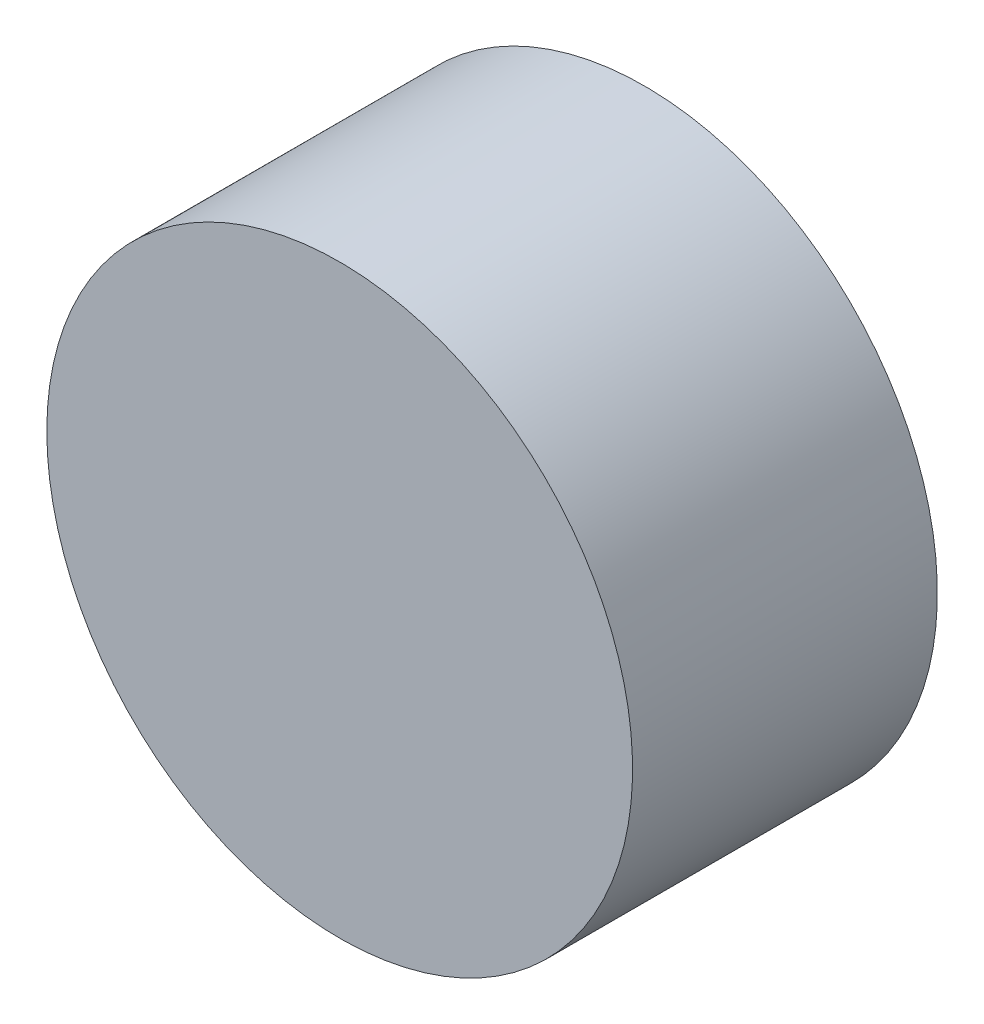
ISO-10303-21;
HEADER;
FILE_DESCRIPTION(('STEP AP214'),'2;1');
FILE_NAME('part.step','',(''),(''),'','','');
FILE_SCHEMA(('AUTOMOTIVE_DESIGN { 1 0 10303 214 1 1 1 1 }'));
ENDSEC;
DATA;
#1=APPLICATION_CONTEXT('core data for automotive mechanical design processes');
#2=APPLICATION_PROTOCOL_DEFINITION('international standard','automotive_design',2000,#1);
#3=PRODUCT_CONTEXT('',#1,'mechanical');
#4=PRODUCT('Part','Part','',(#3));
#5=PRODUCT_RELATED_PRODUCT_CATEGORY('part','',(#4));
#6=PRODUCT_DEFINITION_FORMATION('','',#4);
#7=PRODUCT_DEFINITION_CONTEXT('part definition',#1,'design');
#8=PRODUCT_DEFINITION('design','',#6,#7);
#9=PRODUCT_DEFINITION_SHAPE('','',#8);
#10=(LENGTH_UNIT() NAMED_UNIT(*) SI_UNIT(.MILLI.,.METRE.));
#11=(NAMED_UNIT(*) PLANE_ANGLE_UNIT() SI_UNIT($,.RADIAN.));
#12=(NAMED_UNIT(*) SI_UNIT($,.STERADIAN.) SOLID_ANGLE_UNIT());
#13=UNCERTAINTY_MEASURE_WITH_UNIT(LENGTH_MEASURE(1.E-05),#10,'distance_accuracy_value','');
#14=(GEOMETRIC_REPRESENTATION_CONTEXT(3) GLOBAL_UNCERTAINTY_ASSIGNED_CONTEXT((#13)) GLOBAL_UNIT_ASSIGNED_CONTEXT((#10,
#11,#12)) REPRESENTATION_CONTEXT('',''));
#15=CARTESIAN_POINT('',(0.,0.,0.));
#16=DIRECTION('',(0.,0.,1.));
#17=DIRECTION('',(1.,0.,0.));
#18=AXIS2_PLACEMENT_3D('',#15,#16,#17);
#19=CARTESIAN_POINT('',(0.,-24.5,913.97505065));
#20=DIRECTION('',(0.,0.,-1.));
#21=DIRECTION('',(0.,-1.,0.));
#22=AXIS2_PLACEMENT_3D('',#19,#20,#21);
#23=PLANE('',#22);
#24=CARTESIAN_POINT('',(0.,-24.5,913.97505065));
#25=DIRECTION('',(0.,0.,-1.));
#26=DIRECTION('',(1.,0.,0.));
#27=AXIS2_PLACEMENT_3D('',#24,#25,#26);
#28=CIRCLE('',#27,30.75);
#29=CARTESIAN_POINT('',(-30.75,-24.5,913.97505065));
#30=VERTEX_POINT('',#29);
#31=EDGE_CURVE('E11',#30,#30,#28,.T.);
#32=ORIENTED_EDGE('',*,*,#31,.F.);
#33=EDGE_LOOP('',(#32));
#34=FACE_BOUND('',#33,.T.);
#35=ADVANCED_FACE('F17',(#34),#23,.F.);
#36=CARTESIAN_POINT('',(0.,-24.5,881.97505065));
#37=DIRECTION('',(0.,0.,-1.));
#38=DIRECTION('',(0.,-1.,0.));
#39=AXIS2_PLACEMENT_3D('',#36,#37,#38);
#40=PLANE('',#39);
#41=CARTESIAN_POINT('',(0.,-24.5,881.97505065));
#42=DIRECTION('',(0.,0.,-1.));
#43=DIRECTION('',(1.,0.,0.));
#44=AXIS2_PLACEMENT_3D('',#41,#42,#43);
#45=CIRCLE('',#44,30.75);
#46=CARTESIAN_POINT('',(-30.75,-24.5,881.97505065));
#47=VERTEX_POINT('',#46);
#48=EDGE_CURVE('E26',#47,#47,#45,.T.);
#49=ORIENTED_EDGE('',*,*,#48,.T.);
#50=EDGE_LOOP('',(#49));
#51=FACE_BOUND('',#50,.T.);
#52=ADVANCED_FACE('F41',(#51),#40,.T.);
#53=CARTESIAN_POINT('',(0.,-24.5,881.97505065));
#54=DIRECTION('',(0.,0.,1.));
#55=DIRECTION('',(-1.,0.,0.));
#56=AXIS2_PLACEMENT_3D('',#53,#54,#55);
#57=CYLINDRICAL_SURFACE('',#56,30.75);
#58=ORIENTED_EDGE('',*,*,#31,.T.);
#59=EDGE_LOOP('',(#58));
#60=FACE_BOUND('',#59,.T.);
#61=ORIENTED_EDGE('',*,*,#48,.F.);
#62=EDGE_LOOP('',(#61));
#63=FACE_BOUND('',#62,.T.);
#64=ADVANCED_FACE('F59',(#60,#63),#57,.T.);
#65=CLOSED_SHELL('',(#35,#52,#64));
#66=MANIFOLD_SOLID_BREP('B1',#65);
#67=ADVANCED_BREP_SHAPE_REPRESENTATION('',(#18,#66),#14);
#68=SHAPE_DEFINITION_REPRESENTATION(#9,#67);
ENDSEC;
END-ISO-10303-21;
